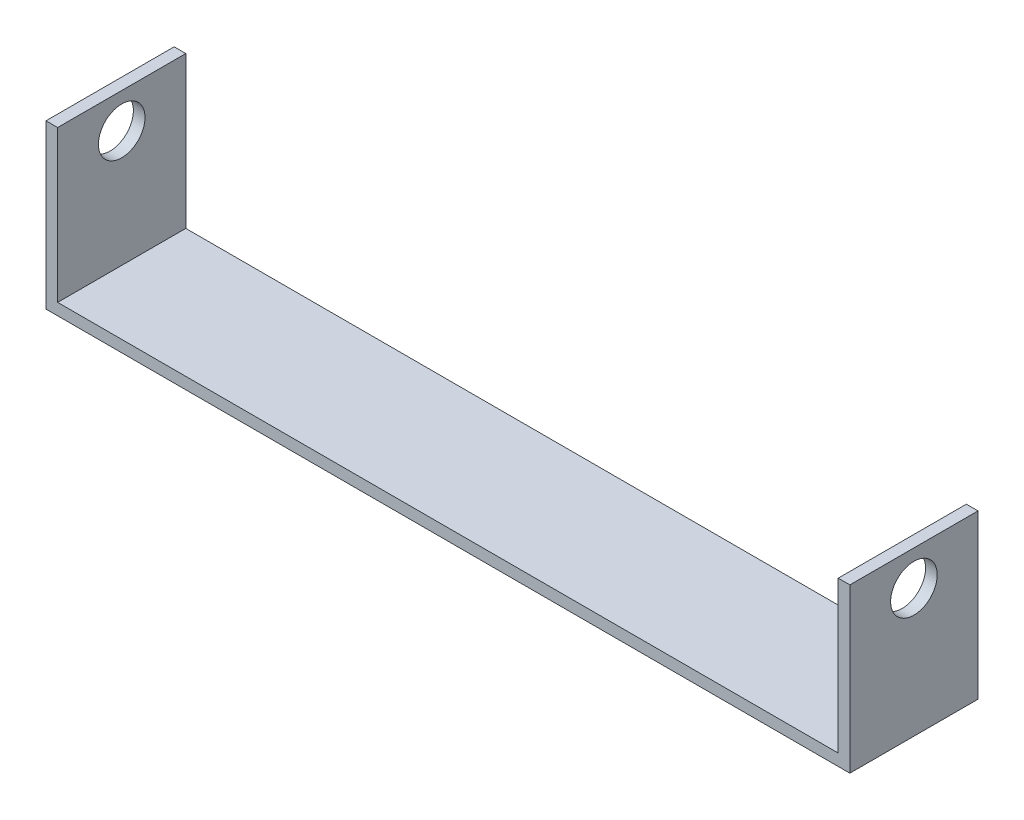
ISO-10303-21;
HEADER;
FILE_DESCRIPTION(('STEP AP214'),'2;1');
FILE_NAME('part.step','',(''),(''),'','','');
FILE_SCHEMA(('AUTOMOTIVE_DESIGN { 1 0 10303 214 1 1 1 1 }'));
ENDSEC;
DATA;
#1=APPLICATION_CONTEXT('core data for automotive mechanical design processes');
#2=APPLICATION_PROTOCOL_DEFINITION('international standard','automotive_design',2000,#1);
#3=PRODUCT_CONTEXT('',#1,'mechanical');
#4=PRODUCT('Part','Part','',(#3));
#5=PRODUCT_RELATED_PRODUCT_CATEGORY('part','',(#4));
#6=PRODUCT_DEFINITION_FORMATION('','',#4);
#7=PRODUCT_DEFINITION_CONTEXT('part definition',#1,'design');
#8=PRODUCT_DEFINITION('design','',#6,#7);
#9=PRODUCT_DEFINITION_SHAPE('','',#8);
#10=(LENGTH_UNIT() NAMED_UNIT(*) SI_UNIT(.MILLI.,.METRE.));
#11=(NAMED_UNIT(*) PLANE_ANGLE_UNIT() SI_UNIT($,.RADIAN.));
#12=(NAMED_UNIT(*) SI_UNIT($,.STERADIAN.) SOLID_ANGLE_UNIT());
#13=UNCERTAINTY_MEASURE_WITH_UNIT(LENGTH_MEASURE(1.E-05),#10,'distance_accuracy_value','');
#14=(GEOMETRIC_REPRESENTATION_CONTEXT(3) GLOBAL_UNCERTAINTY_ASSIGNED_CONTEXT((#13)) GLOBAL_UNIT_ASSIGNED_CONTEXT((#10,
#11,#12)) REPRESENTATION_CONTEXT('',''));
#15=CARTESIAN_POINT('',(0.,0.,0.));
#16=DIRECTION('',(0.,0.,1.));
#17=DIRECTION('',(1.,0.,0.));
#18=AXIS2_PLACEMENT_3D('',#15,#16,#17);
#19=CARTESIAN_POINT('',(-172.5,0.,-27.5));
#20=DIRECTION('',(-1.,0.,0.));
#21=DIRECTION('',(0.,-1.,0.));
#22=AXIS2_PLACEMENT_3D('',#19,#20,#21);
#23=PLANE('',#22);
#24=CARTESIAN_POINT('',(-172.5,55.0000000000007,0.));
#25=DIRECTION('',(1.,0.,0.));
#26=DIRECTION('',(0.,1.,0.));
#27=AXIS2_PLACEMENT_3D('',#24,#25,#26);
#28=CIRCLE('',#27,10.);
#29=CARTESIAN_POINT('',(-172.5,65.0000000000007,0.));
#30=VERTEX_POINT('',#29);
#31=EDGE_CURVE('E237',#30,#30,#28,.T.);
#32=ORIENTED_EDGE('',*,*,#31,.T.);
#33=EDGE_LOOP('',(#32));
#34=FACE_BOUND('',#33,.T.);
#35=DIRECTION('',(0.,0.,1.));
#36=VECTOR('',#35,1.);
#37=CARTESIAN_POINT('',(-172.5,0.,-27.5));
#38=LINE('',#37,#36);
#39=CARTESIAN_POINT('',(-172.5,0.,-27.5));
#40=VERTEX_POINT('',#39);
#41=CARTESIAN_POINT('',(-172.5,0.,27.5));
#42=VERTEX_POINT('',#41);
#43=EDGE_CURVE('E43',#40,#42,#38,.T.);
#44=ORIENTED_EDGE('',*,*,#43,.T.);
#45=DIRECTION('',(0.,-1.,0.));
#46=VECTOR('',#45,1.);
#47=CARTESIAN_POINT('',(-172.5,0.,27.5));
#48=LINE('',#47,#46);
#49=CARTESIAN_POINT('',(-172.5,70.,27.5));
#50=VERTEX_POINT('',#49);
#51=EDGE_CURVE('E104',#50,#42,#48,.T.);
#52=ORIENTED_EDGE('',*,*,#51,.F.);
#53=DIRECTION('',(0.,0.,1.));
#54=VECTOR('',#53,1.);
#55=CARTESIAN_POINT('',(-172.5,70.,-27.5));
#56=LINE('',#55,#54);
#57=CARTESIAN_POINT('',(-172.5,70.,-27.5));
#58=VERTEX_POINT('',#57);
#59=EDGE_CURVE('E11',#58,#50,#56,.T.);
#60=ORIENTED_EDGE('',*,*,#59,.F.);
#61=DIRECTION('',(0.,-1.,0.));
#62=VECTOR('',#61,1.);
#63=CARTESIAN_POINT('',(-172.5,0.,-27.5));
#64=LINE('',#63,#62);
#65=EDGE_CURVE('E105',#58,#40,#64,.T.);
#66=ORIENTED_EDGE('',*,*,#65,.T.);
#67=EDGE_LOOP('',(#44,#52,#60,#66));
#68=FACE_BOUND('',#67,.T.);
#69=ADVANCED_FACE('F40',(#34,#68),#23,.T.);
#70=CARTESIAN_POINT('',(-172.5,70.,-27.5));
#71=DIRECTION('',(0.,1.,0.));
#72=DIRECTION('',(0.,0.,1.));
#73=AXIS2_PLACEMENT_3D('',#70,#71,#72);
#74=PLANE('',#73);
#75=ORIENTED_EDGE('',*,*,#59,.T.);
#76=DIRECTION('',(-1.,0.,0.));
#77=VECTOR('',#76,1.);
#78=CARTESIAN_POINT('',(-172.5,70.,27.5));
#79=LINE('',#78,#77);
#80=CARTESIAN_POINT('',(-167.5,70.,27.5));
#81=VERTEX_POINT('',#80);
#82=EDGE_CURVE('E122',#81,#50,#79,.T.);
#83=ORIENTED_EDGE('',*,*,#82,.F.);
#84=DIRECTION('',(0.,0.,1.));
#85=VECTOR('',#84,1.);
#86=CARTESIAN_POINT('',(-167.5,70.,-27.5));
#87=LINE('',#86,#85);
#88=CARTESIAN_POINT('',(-167.5,70.,-27.5));
#89=VERTEX_POINT('',#88);
#90=EDGE_CURVE('E48',#89,#81,#87,.T.);
#91=ORIENTED_EDGE('',*,*,#90,.F.);
#92=DIRECTION('',(-1.,0.,0.));
#93=VECTOR('',#92,1.);
#94=CARTESIAN_POINT('',(-172.5,70.,-27.5));
#95=LINE('',#94,#93);
#96=EDGE_CURVE('E110',#89,#58,#95,.T.);
#97=ORIENTED_EDGE('',*,*,#96,.T.);
#98=EDGE_LOOP('',(#75,#83,#91,#97));
#99=FACE_BOUND('',#98,.T.);
#100=ADVANCED_FACE('F191',(#99),#74,.T.);
#101=CARTESIAN_POINT('',(-167.5,5.,-27.5));
#102=DIRECTION('',(1.,0.,0.));
#103=DIRECTION('',(0.,1.,0.));
#104=AXIS2_PLACEMENT_3D('',#101,#102,#103);
#105=PLANE('',#104);
#106=CARTESIAN_POINT('',(-167.5,55.0000000000006,0.));
#107=DIRECTION('',(1.,0.,0.));
#108=DIRECTION('',(0.,1.,0.));
#109=AXIS2_PLACEMENT_3D('',#106,#107,#108);
#110=CIRCLE('',#109,10.);
#111=CARTESIAN_POINT('',(-167.5,65.0000000000007,0.));
#112=VERTEX_POINT('',#111);
#113=EDGE_CURVE('E123',#112,#112,#110,.T.);
#114=ORIENTED_EDGE('',*,*,#113,.F.);
#115=EDGE_LOOP('',(#114));
#116=FACE_BOUND('',#115,.T.);
#117=ORIENTED_EDGE('',*,*,#90,.T.);
#118=DIRECTION('',(0.,1.,0.));
#119=VECTOR('',#118,1.);
#120=CARTESIAN_POINT('',(-167.5,5.,27.5));
#121=LINE('',#120,#119);
#122=CARTESIAN_POINT('',(-167.5,5.,27.5));
#123=VERTEX_POINT('',#122);
#124=EDGE_CURVE('E140',#123,#81,#121,.T.);
#125=ORIENTED_EDGE('',*,*,#124,.F.);
#126=DIRECTION('',(0.,0.,1.));
#127=VECTOR('',#126,1.);
#128=CARTESIAN_POINT('',(-167.5,5.,-27.5));
#129=LINE('',#128,#127);
#130=CARTESIAN_POINT('',(-167.5,5.,-27.5));
#131=VERTEX_POINT('',#130);
#132=EDGE_CURVE('E162',#131,#123,#129,.T.);
#133=ORIENTED_EDGE('',*,*,#132,.F.);
#134=DIRECTION('',(0.,1.,0.));
#135=VECTOR('',#134,1.);
#136=CARTESIAN_POINT('',(-167.5,5.,-27.5));
#137=LINE('',#136,#135);
#138=EDGE_CURVE('E158',#131,#89,#137,.T.);
#139=ORIENTED_EDGE('',*,*,#138,.T.);
#140=EDGE_LOOP('',(#117,#125,#133,#139));
#141=FACE_BOUND('',#140,.T.);
#142=ADVANCED_FACE('F190',(#116,#141),#105,.T.);
#143=CARTESIAN_POINT('',(-167.5,5.,-27.5));
#144=DIRECTION('',(0.,1.,0.));
#145=DIRECTION('',(0.,0.,1.));
#146=AXIS2_PLACEMENT_3D('',#143,#144,#145);
#147=PLANE('',#146);
#148=ORIENTED_EDGE('',*,*,#132,.T.);
#149=DIRECTION('',(-1.,0.,0.));
#150=VECTOR('',#149,1.);
#151=CARTESIAN_POINT('',(-167.5,5.,27.5));
#152=LINE('',#151,#150);
#153=CARTESIAN_POINT('',(167.5,5.,27.5));
#154=VERTEX_POINT('',#153);
#155=EDGE_CURVE('E137',#154,#123,#152,.T.);
#156=ORIENTED_EDGE('',*,*,#155,.F.);
#157=DIRECTION('',(0.,0.,1.));
#158=VECTOR('',#157,1.);
#159=CARTESIAN_POINT('',(167.5,5.,-27.5));
#160=LINE('',#159,#158);
#161=CARTESIAN_POINT('',(167.5,5.,-27.5));
#162=VERTEX_POINT('',#161);
#163=EDGE_CURVE('E164',#162,#154,#160,.T.);
#164=ORIENTED_EDGE('',*,*,#163,.F.);
#165=DIRECTION('',(-1.,0.,0.));
#166=VECTOR('',#165,1.);
#167=CARTESIAN_POINT('',(-167.5,5.,-27.5));
#168=LINE('',#167,#166);
#169=EDGE_CURVE('E155',#162,#131,#168,.T.);
#170=ORIENTED_EDGE('',*,*,#169,.T.);
#171=EDGE_LOOP('',(#148,#156,#164,#170));
#172=FACE_BOUND('',#171,.T.);
#173=ADVANCED_FACE('F186',(#172),#147,.T.);
#174=CARTESIAN_POINT('',(167.5,5.,-27.5));
#175=DIRECTION('',(-1.,0.,0.));
#176=DIRECTION('',(0.,-1.,0.));
#177=AXIS2_PLACEMENT_3D('',#174,#175,#176);
#178=PLANE('',#177);
#179=CARTESIAN_POINT('',(167.5,55.,0.));
#180=DIRECTION('',(-1.,0.,0.));
#181=DIRECTION('',(0.,-1.,0.));
#182=AXIS2_PLACEMENT_3D('',#179,#180,#181);
#183=CIRCLE('',#182,10.);
#184=CARTESIAN_POINT('',(167.5,45.,0.));
#185=VERTEX_POINT('',#184);
#186=EDGE_CURVE('E126',#185,#185,#183,.T.);
#187=ORIENTED_EDGE('',*,*,#186,.F.);
#188=EDGE_LOOP('',(#187));
#189=FACE_BOUND('',#188,.T.);
#190=ORIENTED_EDGE('',*,*,#163,.T.);
#191=DIRECTION('',(0.,-1.,0.));
#192=VECTOR('',#191,1.);
#193=CARTESIAN_POINT('',(167.5,5.,27.5));
#194=LINE('',#193,#192);
#195=CARTESIAN_POINT('',(167.5,70.,27.5));
#196=VERTEX_POINT('',#195);
#197=EDGE_CURVE('E134',#196,#154,#194,.T.);
#198=ORIENTED_EDGE('',*,*,#197,.F.);
#199=DIRECTION('',(0.,0.,1.));
#200=VECTOR('',#199,1.);
#201=CARTESIAN_POINT('',(167.5,70.,-27.5));
#202=LINE('',#201,#200);
#203=CARTESIAN_POINT('',(167.5,70.,-27.5));
#204=VERTEX_POINT('',#203);
#205=EDGE_CURVE('E166',#204,#196,#202,.T.);
#206=ORIENTED_EDGE('',*,*,#205,.F.);
#207=DIRECTION('',(0.,-1.,0.));
#208=VECTOR('',#207,1.);
#209=CARTESIAN_POINT('',(167.5,5.,-27.5));
#210=LINE('',#209,#208);
#211=EDGE_CURVE('E152',#204,#162,#210,.T.);
#212=ORIENTED_EDGE('',*,*,#211,.T.);
#213=EDGE_LOOP('',(#190,#198,#206,#212));
#214=FACE_BOUND('',#213,.T.);
#215=ADVANCED_FACE('F179',(#189,#214),#178,.T.);
#216=CARTESIAN_POINT('',(167.5,70.,-27.5));
#217=DIRECTION('',(0.,1.,0.));
#218=DIRECTION('',(0.,0.,1.));
#219=AXIS2_PLACEMENT_3D('',#216,#217,#218);
#220=PLANE('',#219);
#221=ORIENTED_EDGE('',*,*,#205,.T.);
#222=DIRECTION('',(-1.,0.,0.));
#223=VECTOR('',#222,1.);
#224=CARTESIAN_POINT('',(167.5,70.,27.5));
#225=LINE('',#224,#223);
#226=CARTESIAN_POINT('',(172.5,70.,27.5));
#227=VERTEX_POINT('',#226);
#228=EDGE_CURVE('E131',#227,#196,#225,.T.);
#229=ORIENTED_EDGE('',*,*,#228,.F.);
#230=DIRECTION('',(0.,0.,1.));
#231=VECTOR('',#230,1.);
#232=CARTESIAN_POINT('',(172.5,70.,-27.5));
#233=LINE('',#232,#231);
#234=CARTESIAN_POINT('',(172.5,70.,-27.5));
#235=VERTEX_POINT('',#234);
#236=EDGE_CURVE('E168',#235,#227,#233,.T.);
#237=ORIENTED_EDGE('',*,*,#236,.F.);
#238=DIRECTION('',(-1.,0.,0.));
#239=VECTOR('',#238,1.);
#240=CARTESIAN_POINT('',(167.5,70.,-27.5));
#241=LINE('',#240,#239);
#242=EDGE_CURVE('E149',#235,#204,#241,.T.);
#243=ORIENTED_EDGE('',*,*,#242,.T.);
#244=EDGE_LOOP('',(#221,#229,#237,#243));
#245=FACE_BOUND('',#244,.T.);
#246=ADVANCED_FACE('F176',(#245),#220,.T.);
#247=CARTESIAN_POINT('',(172.5,0.,-27.5));
#248=DIRECTION('',(1.,0.,0.));
#249=DIRECTION('',(0.,1.,0.));
#250=AXIS2_PLACEMENT_3D('',#247,#248,#249);
#251=PLANE('',#250);
#252=CARTESIAN_POINT('',(172.5,55.,0.));
#253=DIRECTION('',(1.,0.,0.));
#254=DIRECTION('',(0.,1.,0.));
#255=AXIS2_PLACEMENT_3D('',#252,#253,#254);
#256=CIRCLE('',#255,10.);
#257=CARTESIAN_POINT('',(172.5,65.,0.));
#258=VERTEX_POINT('',#257);
#259=EDGE_CURVE('E236',#258,#258,#256,.T.);
#260=ORIENTED_EDGE('',*,*,#259,.F.);
#261=EDGE_LOOP('',(#260));
#262=FACE_BOUND('',#261,.T.);
#263=ORIENTED_EDGE('',*,*,#236,.T.);
#264=DIRECTION('',(0.,1.,0.));
#265=VECTOR('',#264,1.);
#266=CARTESIAN_POINT('',(172.5,0.,27.5));
#267=LINE('',#266,#265);
#268=CARTESIAN_POINT('',(172.5,0.,27.5));
#269=VERTEX_POINT('',#268);
#270=EDGE_CURVE('E117',#269,#227,#267,.T.);
#271=ORIENTED_EDGE('',*,*,#270,.F.);
#272=DIRECTION('',(0.,0.,1.));
#273=VECTOR('',#272,1.);
#274=CARTESIAN_POINT('',(172.5,0.,-27.5));
#275=LINE('',#274,#273);
#276=CARTESIAN_POINT('',(172.5,0.,-27.5));
#277=VERTEX_POINT('',#276);
#278=EDGE_CURVE('E109',#277,#269,#275,.T.);
#279=ORIENTED_EDGE('',*,*,#278,.F.);
#280=DIRECTION('',(0.,1.,0.));
#281=VECTOR('',#280,1.);
#282=CARTESIAN_POINT('',(172.5,0.,-27.5));
#283=LINE('',#282,#281);
#284=EDGE_CURVE('E146',#277,#235,#283,.T.);
#285=ORIENTED_EDGE('',*,*,#284,.T.);
#286=EDGE_LOOP('',(#263,#271,#279,#285));
#287=FACE_BOUND('',#286,.T.);
#288=ADVANCED_FACE('F170',(#262,#287),#251,.T.);
#289=CARTESIAN_POINT('',(-172.5,0.,-27.5));
#290=DIRECTION('',(0.,-1.,0.));
#291=DIRECTION('',(0.,0.,-1.));
#292=AXIS2_PLACEMENT_3D('',#289,#290,#291);
#293=PLANE('',#292);
#294=ORIENTED_EDGE('',*,*,#278,.T.);
#295=DIRECTION('',(1.,0.,0.));
#296=VECTOR('',#295,1.);
#297=CARTESIAN_POINT('',(-172.5,0.,27.5));
#298=LINE('',#297,#296);
#299=EDGE_CURVE('E112',#42,#269,#298,.T.);
#300=ORIENTED_EDGE('',*,*,#299,.F.);
#301=ORIENTED_EDGE('',*,*,#43,.F.);
#302=DIRECTION('',(1.,0.,0.));
#303=VECTOR('',#302,1.);
#304=CARTESIAN_POINT('',(-172.5,0.,-27.5));
#305=LINE('',#304,#303);
#306=EDGE_CURVE('E144',#40,#277,#305,.T.);
#307=ORIENTED_EDGE('',*,*,#306,.T.);
#308=EDGE_LOOP('',(#294,#300,#301,#307));
#309=FACE_BOUND('',#308,.T.);
#310=ADVANCED_FACE('F113',(#309),#293,.T.);
#311=CARTESIAN_POINT('',(0.,0.,-27.5));
#312=DIRECTION('',(0.,0.,-1.));
#313=DIRECTION('',(-1.,0.,0.));
#314=AXIS2_PLACEMENT_3D('',#311,#312,#313);
#315=PLANE('',#314);
#316=ORIENTED_EDGE('',*,*,#65,.F.);
#317=ORIENTED_EDGE('',*,*,#96,.F.);
#318=ORIENTED_EDGE('',*,*,#138,.F.);
#319=ORIENTED_EDGE('',*,*,#169,.F.);
#320=ORIENTED_EDGE('',*,*,#211,.F.);
#321=ORIENTED_EDGE('',*,*,#242,.F.);
#322=ORIENTED_EDGE('',*,*,#284,.F.);
#323=ORIENTED_EDGE('',*,*,#306,.F.);
#324=EDGE_LOOP('',(#316,#317,#318,#319,#320,#321,#322,#323));
#325=FACE_BOUND('',#324,.T.);
#326=ADVANCED_FACE('F182',(#325),#315,.T.);
#327=CARTESIAN_POINT('',(0.,0.,27.5));
#328=DIRECTION('',(0.,0.,-1.));
#329=DIRECTION('',(-1.,0.,0.));
#330=AXIS2_PLACEMENT_3D('',#327,#328,#329);
#331=PLANE('',#330);
#332=ORIENTED_EDGE('',*,*,#51,.T.);
#333=ORIENTED_EDGE('',*,*,#299,.T.);
#334=ORIENTED_EDGE('',*,*,#270,.T.);
#335=ORIENTED_EDGE('',*,*,#228,.T.);
#336=ORIENTED_EDGE('',*,*,#197,.T.);
#337=ORIENTED_EDGE('',*,*,#155,.T.);
#338=ORIENTED_EDGE('',*,*,#124,.T.);
#339=ORIENTED_EDGE('',*,*,#82,.T.);
#340=EDGE_LOOP('',(#332,#333,#334,#335,#336,#337,#338,#339));
#341=FACE_BOUND('',#340,.T.);
#342=ADVANCED_FACE('F120',(#341),#331,.F.);
#343=CARTESIAN_POINT('',(-172.5,55.0000000000007,0.));
#344=DIRECTION('',(1.,0.,0.));
#345=DIRECTION('',(0.,1.,0.));
#346=AXIS2_PLACEMENT_3D('',#343,#344,#345);
#347=CYLINDRICAL_SURFACE('',#346,10.);
#348=ORIENTED_EDGE('',*,*,#186,.T.);
#349=EDGE_LOOP('',(#348));
#350=FACE_BOUND('',#349,.T.);
#351=ORIENTED_EDGE('',*,*,#259,.T.);
#352=EDGE_LOOP('',(#351));
#353=FACE_BOUND('',#352,.T.);
#354=ADVANCED_FACE('F220',(#350,#353),#347,.F.);
#355=ORIENTED_EDGE('',*,*,#113,.T.);
#356=EDGE_LOOP('',(#355));
#357=FACE_BOUND('',#356,.T.);
#358=ORIENTED_EDGE('',*,*,#31,.F.);
#359=EDGE_LOOP('',(#358));
#360=FACE_BOUND('',#359,.T.);
#361=ADVANCED_FACE('F224',(#357,#360),#347,.F.);
#362=CLOSED_SHELL('',(#69,#100,#142,#173,#215,#246,#288,#310,#326,#342,#354,#361));
#363=MANIFOLD_SOLID_BREP('B2',#362);
#364=ADVANCED_BREP_SHAPE_REPRESENTATION('',(#18,#363),#14);
#365=SHAPE_DEFINITION_REPRESENTATION(#9,#364);
ENDSEC;
END-ISO-10303-21;
